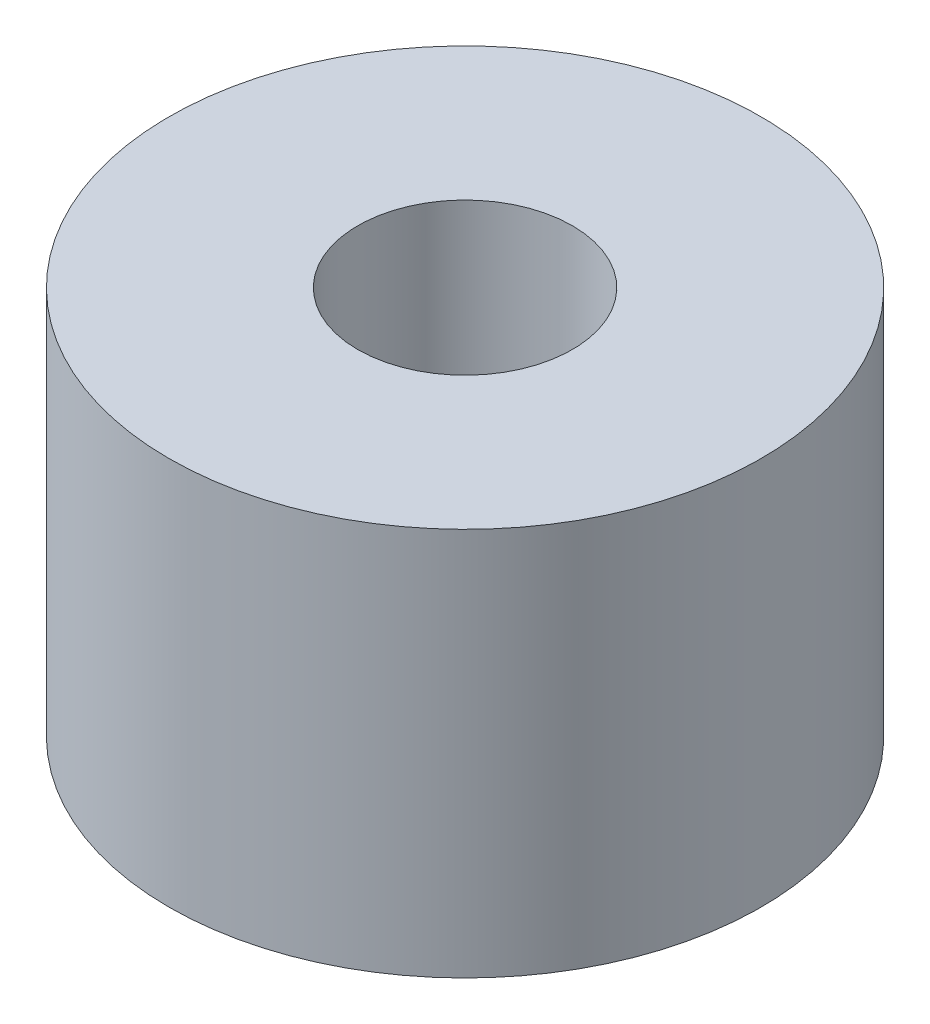
ISO-10303-21;
HEADER;
FILE_DESCRIPTION(('STEP AP214'),'2;1');
FILE_NAME('part.step','',(''),(''),'','','');
FILE_SCHEMA(('AUTOMOTIVE_DESIGN { 1 0 10303 214 1 1 1 1 }'));
ENDSEC;
DATA;
#1=APPLICATION_CONTEXT('core data for automotive mechanical design processes');
#2=APPLICATION_PROTOCOL_DEFINITION('international standard','automotive_design',2000,#1);
#3=PRODUCT_CONTEXT('',#1,'mechanical');
#4=PRODUCT('Part','Part','',(#3));
#5=PRODUCT_RELATED_PRODUCT_CATEGORY('part','',(#4));
#6=PRODUCT_DEFINITION_FORMATION('','',#4);
#7=PRODUCT_DEFINITION_CONTEXT('part definition',#1,'design');
#8=PRODUCT_DEFINITION('design','',#6,#7);
#9=PRODUCT_DEFINITION_SHAPE('','',#8);
#10=(LENGTH_UNIT() NAMED_UNIT(*) SI_UNIT(.MILLI.,.METRE.));
#11=(NAMED_UNIT(*) PLANE_ANGLE_UNIT() SI_UNIT($,.RADIAN.));
#12=(NAMED_UNIT(*) SI_UNIT($,.STERADIAN.) SOLID_ANGLE_UNIT());
#13=UNCERTAINTY_MEASURE_WITH_UNIT(LENGTH_MEASURE(1.E-05),#10,'distance_accuracy_value','');
#14=(GEOMETRIC_REPRESENTATION_CONTEXT(3) GLOBAL_UNCERTAINTY_ASSIGNED_CONTEXT((#13)) GLOBAL_UNIT_ASSIGNED_CONTEXT((#10,
#11,#12)) REPRESENTATION_CONTEXT('',''));
#15=CARTESIAN_POINT('',(0.,0.,0.));
#16=DIRECTION('',(0.,0.,1.));
#17=DIRECTION('',(1.,0.,0.));
#18=AXIS2_PLACEMENT_3D('',#15,#16,#17);
#19=CARTESIAN_POINT('',(0.,5.25,0.));
#20=DIRECTION('',(0.,1.,0.));
#21=DIRECTION('',(0.,0.,1.));
#22=AXIS2_PLACEMENT_3D('',#19,#20,#21);
#23=PLANE('',#22);
#24=CARTESIAN_POINT('',(0.,5.25,0.));
#25=DIRECTION('',(0.,1.,0.));
#26=DIRECTION('',(0.,0.,1.));
#27=AXIS2_PLACEMENT_3D('',#24,#25,#26);
#28=CIRCLE('',#27,4.);
#29=CARTESIAN_POINT('',(0.,5.25,4.));
#30=VERTEX_POINT('',#29);
#31=EDGE_CURVE('E10',#30,#30,#28,.T.);
#32=ORIENTED_EDGE('',*,*,#31,.T.);
#33=EDGE_LOOP('',(#32));
#34=FACE_BOUND('',#33,.T.);
#35=CARTESIAN_POINT('',(0.,5.25,0.));
#36=DIRECTION('',(0.,1.,0.));
#37=DIRECTION('',(0.,0.,1.));
#38=AXIS2_PLACEMENT_3D('',#35,#36,#37);
#39=CIRCLE('',#38,1.45);
#40=CARTESIAN_POINT('',(0.,5.25,1.45));
#41=VERTEX_POINT('',#40);
#42=EDGE_CURVE('E54',#41,#41,#39,.T.);
#43=ORIENTED_EDGE('',*,*,#42,.F.);
#44=EDGE_LOOP('',(#43));
#45=FACE_BOUND('',#44,.T.);
#46=ADVANCED_FACE('F41',(#34,#45),#23,.T.);
#47=CARTESIAN_POINT('',(0.,0.,0.));
#48=DIRECTION('',(0.,1.,0.));
#49=DIRECTION('',(0.,0.,1.));
#50=AXIS2_PLACEMENT_3D('',#47,#48,#49);
#51=PLANE('',#50);
#52=CARTESIAN_POINT('',(0.,0.,0.));
#53=DIRECTION('',(0.,1.,0.));
#54=DIRECTION('',(0.,0.,1.));
#55=AXIS2_PLACEMENT_3D('',#52,#53,#54);
#56=CIRCLE('',#55,4.);
#57=CARTESIAN_POINT('',(0.,0.,4.));
#58=VERTEX_POINT('',#57);
#59=EDGE_CURVE('E45',#58,#58,#56,.T.);
#60=ORIENTED_EDGE('',*,*,#59,.F.);
#61=EDGE_LOOP('',(#60));
#62=FACE_BOUND('',#61,.T.);
#63=CARTESIAN_POINT('',(0.,0.,0.));
#64=DIRECTION('',(0.,1.,0.));
#65=DIRECTION('',(0.,0.,1.));
#66=AXIS2_PLACEMENT_3D('',#63,#64,#65);
#67=CIRCLE('',#66,1.45);
#68=CARTESIAN_POINT('',(0.,0.,1.45));
#69=VERTEX_POINT('',#68);
#70=EDGE_CURVE('E56',#69,#69,#67,.T.);
#71=ORIENTED_EDGE('',*,*,#70,.T.);
#72=EDGE_LOOP('',(#71));
#73=FACE_BOUND('',#72,.T.);
#74=ADVANCED_FACE('F68',(#62,#73),#51,.F.);
#75=CARTESIAN_POINT('',(0.,5.25,0.));
#76=DIRECTION('',(0.,-1.,0.));
#77=DIRECTION('',(0.,0.,-1.));
#78=AXIS2_PLACEMENT_3D('',#75,#76,#77);
#79=CYLINDRICAL_SURFACE('',#78,4.);
#80=ORIENTED_EDGE('',*,*,#31,.F.);
#81=EDGE_LOOP('',(#80));
#82=FACE_BOUND('',#81,.T.);
#83=ORIENTED_EDGE('',*,*,#59,.T.);
#84=EDGE_LOOP('',(#83));
#85=FACE_BOUND('',#84,.T.);
#86=ADVANCED_FACE('F43',(#82,#85),#79,.T.);
#87=CARTESIAN_POINT('',(0.,5.25,0.));
#88=DIRECTION('',(0.,-1.,0.));
#89=DIRECTION('',(0.,0.,-1.));
#90=AXIS2_PLACEMENT_3D('',#87,#88,#89);
#91=CYLINDRICAL_SURFACE('',#90,1.45);
#92=ORIENTED_EDGE('',*,*,#42,.T.);
#93=EDGE_LOOP('',(#92));
#94=FACE_BOUND('',#93,.T.);
#95=ORIENTED_EDGE('',*,*,#70,.F.);
#96=EDGE_LOOP('',(#95));
#97=FACE_BOUND('',#96,.T.);
#98=ADVANCED_FACE('F64',(#94,#97),#91,.F.);
#99=CLOSED_SHELL('',(#46,#74,#86,#98));
#100=MANIFOLD_SOLID_BREP('B2',#99);
#101=ADVANCED_BREP_SHAPE_REPRESENTATION('',(#18,#100),#14);
#102=SHAPE_DEFINITION_REPRESENTATION(#9,#101);
ENDSEC;
END-ISO-10303-21;
